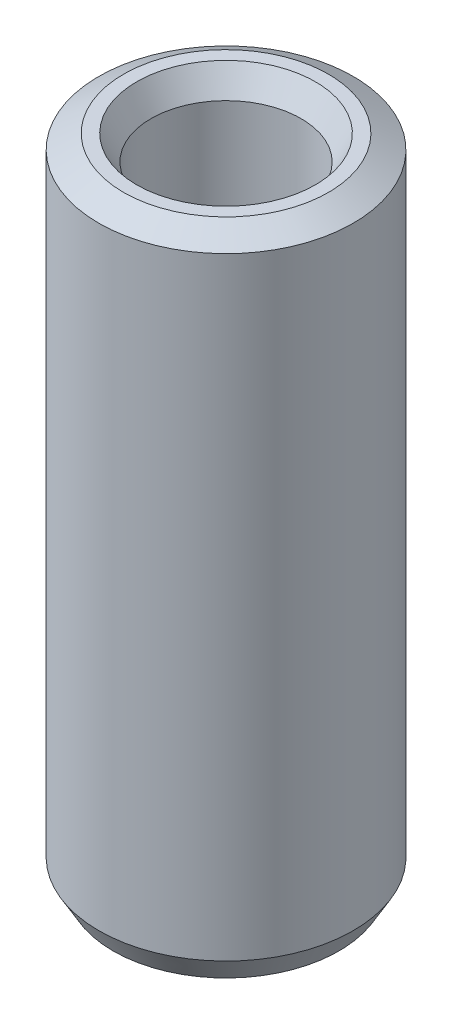
ISO-10303-21;
HEADER;
FILE_DESCRIPTION(('STEP AP214'),'2;1');
FILE_NAME('part.step','',(''),(''),'','','');
FILE_SCHEMA(('AUTOMOTIVE_DESIGN { 1 0 10303 214 1 1 1 1 }'));
ENDSEC;
DATA;
#1=APPLICATION_CONTEXT('core data for automotive mechanical design processes');
#2=APPLICATION_PROTOCOL_DEFINITION('international standard','automotive_design',2000,#1);
#3=PRODUCT_CONTEXT('',#1,'mechanical');
#4=PRODUCT('Part','Part','',(#3));
#5=PRODUCT_RELATED_PRODUCT_CATEGORY('part','',(#4));
#6=PRODUCT_DEFINITION_FORMATION('','',#4);
#7=PRODUCT_DEFINITION_CONTEXT('part definition',#1,'design');
#8=PRODUCT_DEFINITION('design','',#6,#7);
#9=PRODUCT_DEFINITION_SHAPE('','',#8);
#10=(LENGTH_UNIT() NAMED_UNIT(*) SI_UNIT(.MILLI.,.METRE.));
#11=(NAMED_UNIT(*) PLANE_ANGLE_UNIT() SI_UNIT($,.RADIAN.));
#12=(NAMED_UNIT(*) SI_UNIT($,.STERADIAN.) SOLID_ANGLE_UNIT());
#13=UNCERTAINTY_MEASURE_WITH_UNIT(LENGTH_MEASURE(1.E-05),#10,'distance_accuracy_value','');
#14=(GEOMETRIC_REPRESENTATION_CONTEXT(3) GLOBAL_UNCERTAINTY_ASSIGNED_CONTEXT((#13)) GLOBAL_UNIT_ASSIGNED_CONTEXT((#10,
#11,#12)) REPRESENTATION_CONTEXT('',''));
#15=CARTESIAN_POINT('',(0.,0.,0.));
#16=DIRECTION('',(0.,0.,1.));
#17=DIRECTION('',(1.,0.,0.));
#18=AXIS2_PLACEMENT_3D('',#15,#16,#17);
#19=CARTESIAN_POINT('',(0.,64.037781043431,0.));
#20=DIRECTION('',(0.,-1.,0.));
#21=DIRECTION('',(0.,0.,-1.));
#22=AXIS2_PLACEMENT_3D('',#19,#20,#21);
#23=CYLINDRICAL_SURFACE('',#22,12.5);
#24=CARTESIAN_POINT('',(0.,2.43335889523669,0.));
#25=DIRECTION('',(0.,1.,0.));
#26=DIRECTION('',(0.,0.,1.));
#27=AXIS2_PLACEMENT_3D('',#24,#25,#26);
#28=CIRCLE('',#27,12.5);
#29=CARTESIAN_POINT('',(0.,2.43335889523669,12.5));
#30=VERTEX_POINT('',#29);
#31=EDGE_CURVE('E10',#30,#30,#28,.T.);
#32=ORIENTED_EDGE('',*,*,#31,.T.);
#33=EDGE_LOOP('',(#32));
#34=FACE_BOUND('',#33,.T.);
#35=CARTESIAN_POINT('',(0.,62.6328806302311,0.));
#36=DIRECTION('',(0.,1.,0.));
#37=DIRECTION('',(0.,0.,1.));
#38=AXIS2_PLACEMENT_3D('',#35,#36,#37);
#39=CIRCLE('',#38,12.5);
#40=CARTESIAN_POINT('',(0.,62.6328806302311,12.5));
#41=VERTEX_POINT('',#40);
#42=EDGE_CURVE('E50',#41,#41,#39,.F.);
#43=ORIENTED_EDGE('',*,*,#42,.T.);
#44=EDGE_LOOP('',(#43));
#45=FACE_BOUND('',#44,.T.);
#46=ADVANCED_FACE('F39',(#34,#45),#23,.T.);
#47=CARTESIAN_POINT('',(0.,64.037781043431,0.));
#48=DIRECTION('',(0.,1.,0.));
#49=DIRECTION('',(0.,0.,1.));
#50=AXIS2_PLACEMENT_3D('',#47,#48,#49);
#51=PLANE('',#50);
#52=CARTESIAN_POINT('',(0.,64.037781043431,0.));
#53=DIRECTION('',(0.,1.,0.));
#54=DIRECTION('',(0.,0.,1.));
#55=AXIS2_PLACEMENT_3D('',#52,#53,#54);
#56=CIRCLE('',#55,8.77965142328003);
#57=CARTESIAN_POINT('',(0.,64.037781043431,8.77965142328003));
#58=VERTEX_POINT('',#57);
#59=EDGE_CURVE('E58',#58,#58,#56,.F.);
#60=ORIENTED_EDGE('',*,*,#59,.T.);
#61=EDGE_LOOP('',(#60));
#62=FACE_BOUND('',#61,.T.);
#63=CARTESIAN_POINT('',(0.,64.037781043431,0.));
#64=DIRECTION('',(0.,1.,0.));
#65=DIRECTION('',(0.,0.,1.));
#66=AXIS2_PLACEMENT_3D('',#63,#64,#65);
#67=CIRCLE('',#66,10.0666411047633);
#68=CARTESIAN_POINT('',(0.,64.037781043431,10.0666411047633));
#69=VERTEX_POINT('',#68);
#70=EDGE_CURVE('E61',#69,#69,#67,.T.);
#71=ORIENTED_EDGE('',*,*,#70,.T.);
#72=EDGE_LOOP('',(#71));
#73=FACE_BOUND('',#72,.T.);
#74=ADVANCED_FACE('F88',(#62,#73),#51,.T.);
#75=CARTESIAN_POINT('',(0.,0.,0.));
#76=DIRECTION('',(0.,1.,0.));
#77=DIRECTION('',(0.,0.,1.));
#78=AXIS2_PLACEMENT_3D('',#75,#76,#77);
#79=PLANE('',#78);
#80=CARTESIAN_POINT('',(0.,0.,0.));
#81=DIRECTION('',(0.,1.,0.));
#82=DIRECTION('',(0.,0.,1.));
#83=AXIS2_PLACEMENT_3D('',#80,#81,#82);
#84=CIRCLE('',#83,9.80810990531686);
#85=CARTESIAN_POINT('',(0.,0.,9.80810990531686));
#86=VERTEX_POINT('',#85);
#87=EDGE_CURVE('E51',#86,#86,#84,.T.);
#88=ORIENTED_EDGE('',*,*,#87,.T.);
#89=EDGE_LOOP('',(#88));
#90=FACE_BOUND('',#89,.T.);
#91=CARTESIAN_POINT('',(0.,0.,0.));
#92=DIRECTION('',(0.,1.,0.));
#93=DIRECTION('',(0.,0.,1.));
#94=AXIS2_PLACEMENT_3D('',#91,#92,#93);
#95=CIRCLE('',#94,11.0950995868001);
#96=CARTESIAN_POINT('',(0.,0.,11.0950995868001));
#97=VERTEX_POINT('',#96);
#98=EDGE_CURVE('E54',#97,#97,#95,.F.);
#99=ORIENTED_EDGE('',*,*,#98,.T.);
#100=EDGE_LOOP('',(#99));
#101=FACE_BOUND('',#100,.T.);
#102=ADVANCED_FACE('F83',(#90,#101),#79,.F.);
#103=CARTESIAN_POINT('',(0.,64.037781043431,0.));
#104=DIRECTION('',(0.,-1.,0.));
#105=DIRECTION('',(0.,0.,-1.));
#106=AXIS2_PLACEMENT_3D('',#103,#104,#105);
#107=CYLINDRICAL_SURFACE('',#106,7.37475101008015);
#108=CARTESIAN_POINT('',(0.,61.6044221481943,0.));
#109=DIRECTION('',(0.,1.,0.));
#110=DIRECTION('',(0.,0.,1.));
#111=AXIS2_PLACEMENT_3D('',#108,#109,#110);
#112=CIRCLE('',#111,7.37475101008015);
#113=CARTESIAN_POINT('',(0.,61.6044221481943,7.37475101008015));
#114=VERTEX_POINT('',#113);
#115=EDGE_CURVE('E67',#114,#114,#112,.T.);
#116=ORIENTED_EDGE('',*,*,#115,.T.);
#117=EDGE_LOOP('',(#116));
#118=FACE_BOUND('',#117,.T.);
#119=CARTESIAN_POINT('',(0.,1.40490041319989,0.));
#120=DIRECTION('',(0.,1.,0.));
#121=DIRECTION('',(0.,0.,1.));
#122=AXIS2_PLACEMENT_3D('',#119,#120,#121);
#123=CIRCLE('',#122,7.37475101008015);
#124=CARTESIAN_POINT('',(0.,1.40490041319989,7.37475101008015));
#125=VERTEX_POINT('',#124);
#126=EDGE_CURVE('E69',#125,#125,#123,.F.);
#127=ORIENTED_EDGE('',*,*,#126,.T.);
#128=EDGE_LOOP('',(#127));
#129=FACE_BOUND('',#128,.T.);
#130=ADVANCED_FACE('F71',(#118,#129),#107,.F.);
#131=CARTESIAN_POINT('',(0.,61.6044221481943,0.));
#132=DIRECTION('',(0.,1.,0.));
#133=DIRECTION('',(0.,0.,1.));
#134=AXIS2_PLACEMENT_3D('',#131,#132,#133);
#135=CONICAL_SURFACE('',#134,7.37475101008015,0.5235987755983);
#136=ORIENTED_EDGE('',*,*,#59,.F.);
#137=EDGE_LOOP('',(#136));
#138=FACE_BOUND('',#137,.T.);
#139=ORIENTED_EDGE('',*,*,#115,.F.);
#140=EDGE_LOOP('',(#139));
#141=FACE_BOUND('',#140,.T.);
#142=ADVANCED_FACE('F77',(#138,#141),#135,.F.);
#143=CARTESIAN_POINT('',(0.,0.,0.));
#144=DIRECTION('',(0.,-1.,0.));
#145=DIRECTION('',(0.,0.,-1.));
#146=AXIS2_PLACEMENT_3D('',#143,#144,#145);
#147=CONICAL_SURFACE('',#146,9.80810990531686,1.0471975511966);
#148=ORIENTED_EDGE('',*,*,#126,.F.);
#149=EDGE_LOOP('',(#148));
#150=FACE_BOUND('',#149,.T.);
#151=ORIENTED_EDGE('',*,*,#87,.F.);
#152=EDGE_LOOP('',(#151));
#153=FACE_BOUND('',#152,.T.);
#154=ADVANCED_FACE('F73',(#150,#153),#147,.F.);
#155=CARTESIAN_POINT('',(0.,2.43335889523669,0.));
#156=DIRECTION('',(0.,1.,0.));
#157=DIRECTION('',(0.,0.,1.));
#158=AXIS2_PLACEMENT_3D('',#155,#156,#157);
#159=CONICAL_SURFACE('',#158,12.5,0.523598775598302);
#160=ORIENTED_EDGE('',*,*,#98,.F.);
#161=EDGE_LOOP('',(#160));
#162=FACE_BOUND('',#161,.T.);
#163=ORIENTED_EDGE('',*,*,#31,.F.);
#164=EDGE_LOOP('',(#163));
#165=FACE_BOUND('',#164,.T.);
#166=ADVANCED_FACE('F76',(#162,#165),#159,.T.);
#167=CARTESIAN_POINT('',(0.,64.037781043431,0.));
#168=DIRECTION('',(0.,-1.,0.));
#169=DIRECTION('',(0.,0.,-1.));
#170=AXIS2_PLACEMENT_3D('',#167,#168,#169);
#171=CONICAL_SURFACE('',#170,10.0666411047633,1.0471975511966);
#172=ORIENTED_EDGE('',*,*,#42,.F.);
#173=EDGE_LOOP('',(#172));
#174=FACE_BOUND('',#173,.T.);
#175=ORIENTED_EDGE('',*,*,#70,.F.);
#176=EDGE_LOOP('',(#175));
#177=FACE_BOUND('',#176,.T.);
#178=ADVANCED_FACE('F45',(#174,#177),#171,.T.);
#179=CLOSED_SHELL('',(#46,#74,#102,#130,#142,#154,#166,#178));
#180=MANIFOLD_SOLID_BREP('B2',#179);
#181=ADVANCED_BREP_SHAPE_REPRESENTATION('',(#18,#180),#14);
#182=SHAPE_DEFINITION_REPRESENTATION(#9,#181);
ENDSEC;
END-ISO-10303-21;
